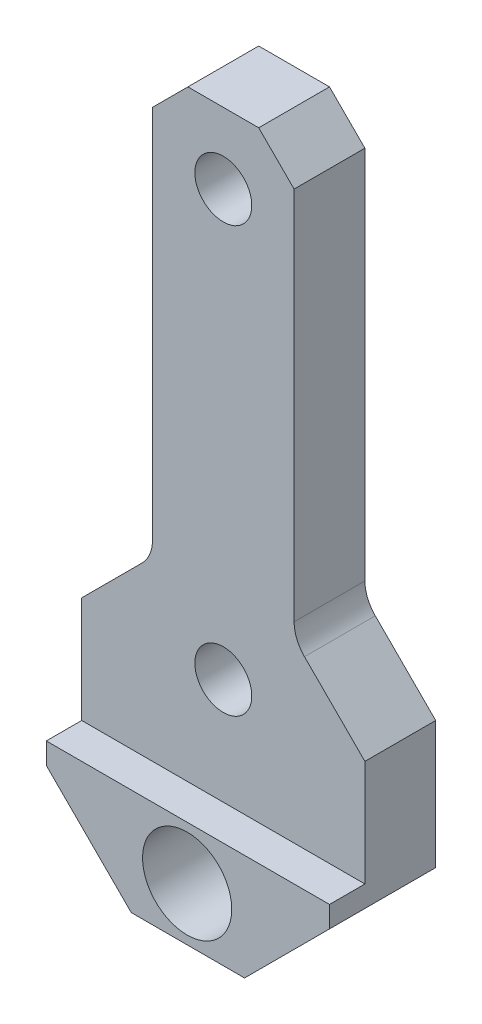
ISO-10303-21;
HEADER;
FILE_DESCRIPTION(('STEP AP214'),'2;1');
FILE_NAME('part.step','',(''),(''),'','','');
FILE_SCHEMA(('AUTOMOTIVE_DESIGN { 1 0 10303 214 1 1 1 1 }'));
ENDSEC;
DATA;
#1=APPLICATION_CONTEXT('core data for automotive mechanical design processes');
#2=APPLICATION_PROTOCOL_DEFINITION('international standard','automotive_design',2000,#1);
#3=PRODUCT_CONTEXT('',#1,'mechanical');
#4=PRODUCT('Part','Part','',(#3));
#5=PRODUCT_RELATED_PRODUCT_CATEGORY('part','',(#4));
#6=PRODUCT_DEFINITION_FORMATION('','',#4);
#7=PRODUCT_DEFINITION_CONTEXT('part definition',#1,'design');
#8=PRODUCT_DEFINITION('design','',#6,#7);
#9=PRODUCT_DEFINITION_SHAPE('','',#8);
#10=(LENGTH_UNIT() NAMED_UNIT(*) SI_UNIT(.MILLI.,.METRE.));
#11=(NAMED_UNIT(*) PLANE_ANGLE_UNIT() SI_UNIT($,.RADIAN.));
#12=(NAMED_UNIT(*) SI_UNIT($,.STERADIAN.) SOLID_ANGLE_UNIT());
#13=UNCERTAINTY_MEASURE_WITH_UNIT(LENGTH_MEASURE(1.E-05),#10,'distance_accuracy_value','');
#14=(GEOMETRIC_REPRESENTATION_CONTEXT(3) GLOBAL_UNCERTAINTY_ASSIGNED_CONTEXT((#13)) GLOBAL_UNIT_ASSIGNED_CONTEXT((#10,
#11,#12)) REPRESENTATION_CONTEXT('',''));
#15=CARTESIAN_POINT('',(0.,0.,0.));
#16=DIRECTION('',(0.,0.,1.));
#17=DIRECTION('',(1.,0.,0.));
#18=AXIS2_PLACEMENT_3D('',#15,#16,#17);
#19=CARTESIAN_POINT('',(0.,0.,0.));
#20=DIRECTION('',(0.,0.,1.));
#21=DIRECTION('',(1.,0.,0.));
#22=AXIS2_PLACEMENT_3D('',#19,#20,#21);
#23=PLANE('',#22);
#24=CARTESIAN_POINT('',(50.7326430152227,-4.7625,0.));
#25=DIRECTION('',(0.,0.,-1.));
#26=DIRECTION('',(-1.,0.,0.));
#27=AXIS2_PLACEMENT_3D('',#24,#25,#26);
#28=CIRCLE('',#27,4.);
#29=CARTESIAN_POINT('',(46.7326430152227,-4.7625,0.));
#30=VERTEX_POINT('',#29);
#31=EDGE_CURVE('E301',#30,#30,#28,.T.);
#32=ORIENTED_EDGE('',*,*,#31,.F.);
#33=EDGE_LOOP('',(#32));
#34=FACE_BOUND('',#33,.T.);
#35=CARTESIAN_POINT('',(50.8,9.525,0.));
#36=DIRECTION('',(0.,0.,-1.));
#37=DIRECTION('',(-1.,0.,0.));
#38=AXIS2_PLACEMENT_3D('',#35,#36,#37);
#39=CIRCLE('',#38,2.5527);
#40=CARTESIAN_POINT('',(48.2473,9.525,0.));
#41=VERTEX_POINT('',#40);
#42=EDGE_CURVE('E192',#41,#41,#39,.T.);
#43=ORIENTED_EDGE('',*,*,#42,.F.);
#44=EDGE_LOOP('',(#43));
#45=FACE_BOUND('',#44,.T.);
#46=DIRECTION('',(0.,-1.,0.));
#47=VECTOR('',#46,1.);
#48=CARTESIAN_POINT('',(44.45,53.975,0.));
#49=LINE('',#48,#47);
#50=CARTESIAN_POINT('',(44.45,50.8,0.));
#51=VERTEX_POINT('',#50);
#52=CARTESIAN_POINT('',(44.45,17.1901280605346,0.));
#53=VERTEX_POINT('',#52);
#54=EDGE_CURVE('E296',#51,#53,#49,.T.);
#55=ORIENTED_EDGE('',*,*,#54,.F.);
#56=DIRECTION('',(-0.707106781186548,-0.707106781186548,0.));
#57=VECTOR('',#56,1.);
#58=CARTESIAN_POINT('',(44.45,50.8,0.));
#59=LINE('',#58,#57);
#60=CARTESIAN_POINT('',(47.625,53.975,0.));
#61=VERTEX_POINT('',#60);
#62=EDGE_CURVE('E275',#51,#61,#59,.F.);
#63=ORIENTED_EDGE('',*,*,#62,.T.);
#64=DIRECTION('',(-1.,0.,0.));
#65=VECTOR('',#64,1.);
#66=CARTESIAN_POINT('',(57.15,53.975,0.));
#67=LINE('',#66,#65);
#68=CARTESIAN_POINT('',(53.975,53.975,0.));
#69=VERTEX_POINT('',#68);
#70=EDGE_CURVE('E295',#69,#61,#67,.T.);
#71=ORIENTED_EDGE('',*,*,#70,.F.);
#72=DIRECTION('',(-0.707106781186548,0.707106781186548,0.));
#73=VECTOR('',#72,1.);
#74=CARTESIAN_POINT('',(53.975,53.975,0.));
#75=LINE('',#74,#73);
#76=CARTESIAN_POINT('',(57.15,50.8,0.));
#77=VERTEX_POINT('',#76);
#78=EDGE_CURVE('E273',#69,#77,#75,.F.);
#79=ORIENTED_EDGE('',*,*,#78,.T.);
#80=DIRECTION('',(0.,1.,0.));
#81=VECTOR('',#80,1.);
#82=CARTESIAN_POINT('',(57.15,53.975,0.));
#83=LINE('',#82,#81);
#84=CARTESIAN_POINT('',(57.15,17.1901280605346,0.));
#85=VERTEX_POINT('',#84);
#86=EDGE_CURVE('E299',#85,#77,#83,.T.);
#87=ORIENTED_EDGE('',*,*,#86,.F.);
#88=CARTESIAN_POINT('',(60.325,17.1901280605346,0.));
#89=DIRECTION('',(0.,0.,1.));
#90=DIRECTION('',(1.,0.,0.));
#91=AXIS2_PLACEMENT_3D('',#88,#89,#90);
#92=CIRCLE('',#91,3.175);
#93=CARTESIAN_POINT('',(58.0799359697327,14.9450640302673,0.));
#94=VERTEX_POINT('',#93);
#95=EDGE_CURVE('E266',#85,#94,#92,.T.);
#96=ORIENTED_EDGE('',*,*,#95,.T.);
#97=DIRECTION('',(-0.707106781186549,0.707106781186546,0.));
#98=VECTOR('',#97,1.);
#99=CARTESIAN_POINT('',(63.5,9.52500000000001,0.));
#100=LINE('',#99,#98);
#101=CARTESIAN_POINT('',(63.5,9.52500000000001,0.));
#102=VERTEX_POINT('',#101);
#103=EDGE_CURVE('E238',#94,#102,#100,.F.);
#104=ORIENTED_EDGE('',*,*,#103,.T.);
#105=DIRECTION('',(0.,1.,0.));
#106=VECTOR('',#105,1.);
#107=CARTESIAN_POINT('',(63.5,57.15,0.));
#108=LINE('',#107,#106);
#109=CARTESIAN_POINT('',(63.5,-1.90499999999998,0.));
#110=VERTEX_POINT('',#109);
#111=EDGE_CURVE('E198',#110,#102,#108,.T.);
#112=ORIENTED_EDGE('',*,*,#111,.F.);
#113=DIRECTION('',(0.707106781186548,0.707106781186547,0.));
#114=VECTOR('',#113,1.);
#115=CARTESIAN_POINT('',(63.5,-1.90499999999998,0.));
#116=LINE('',#115,#114);
#117=CARTESIAN_POINT('',(55.88,-9.525,0.));
#118=VERTEX_POINT('',#117);
#119=EDGE_CURVE('E216',#110,#118,#116,.F.);
#120=ORIENTED_EDGE('',*,*,#119,.T.);
#121=DIRECTION('',(1.,0.,0.));
#122=VECTOR('',#121,1.);
#123=CARTESIAN_POINT('',(38.1,-9.525,0.));
#124=LINE('',#123,#122);
#125=CARTESIAN_POINT('',(45.72,-9.525,0.));
#126=VERTEX_POINT('',#125);
#127=EDGE_CURVE('E205',#126,#118,#124,.T.);
#128=ORIENTED_EDGE('',*,*,#127,.F.);
#129=DIRECTION('',(0.707106781186548,-0.707106781186547,0.));
#130=VECTOR('',#129,1.);
#131=CARTESIAN_POINT('',(45.72,-9.525,0.));
#132=LINE('',#131,#130);
#133=CARTESIAN_POINT('',(38.1,-1.90499999999999,0.));
#134=VERTEX_POINT('',#133);
#135=EDGE_CURVE('E218',#126,#134,#132,.F.);
#136=ORIENTED_EDGE('',*,*,#135,.T.);
#137=DIRECTION('',(0.,-1.,0.));
#138=VECTOR('',#137,1.);
#139=CARTESIAN_POINT('',(38.1,57.15,0.));
#140=LINE('',#139,#138);
#141=CARTESIAN_POINT('',(38.1,9.52500000000001,0.));
#142=VERTEX_POINT('',#141);
#143=EDGE_CURVE('E195',#142,#134,#140,.T.);
#144=ORIENTED_EDGE('',*,*,#143,.F.);
#145=DIRECTION('',(-0.707106781186548,-0.707106781186547,0.));
#146=VECTOR('',#145,1.);
#147=CARTESIAN_POINT('',(38.1,9.52500000000001,0.));
#148=LINE('',#147,#146);
#149=CARTESIAN_POINT('',(43.5200640302673,14.9450640302673,0.));
#150=VERTEX_POINT('',#149);
#151=EDGE_CURVE('E240',#142,#150,#148,.F.);
#152=ORIENTED_EDGE('',*,*,#151,.T.);
#153=CARTESIAN_POINT('',(41.275,17.1901280605346,0.));
#154=DIRECTION('',(0.,0.,1.));
#155=DIRECTION('',(1.,0.,0.));
#156=AXIS2_PLACEMENT_3D('',#153,#154,#155);
#157=CIRCLE('',#156,3.175);
#158=EDGE_CURVE('E261',#150,#53,#157,.T.);
#159=ORIENTED_EDGE('',*,*,#158,.T.);
#160=EDGE_LOOP('',(#55,#63,#71,#79,#87,#96,#104,#112,#120,#128,#136,#144,#152,#159));
#161=FACE_BOUND('',#160,.T.);
#162=CARTESIAN_POINT('',(50.8,47.625,0.));
#163=DIRECTION('',(0.,0.,-1.));
#164=DIRECTION('',(-1.,0.,0.));
#165=AXIS2_PLACEMENT_3D('',#162,#163,#164);
#166=CIRCLE('',#165,2.5527);
#167=CARTESIAN_POINT('',(48.2473,47.625,0.));
#168=VERTEX_POINT('',#167);
#169=EDGE_CURVE('E189',#168,#168,#166,.T.);
#170=ORIENTED_EDGE('',*,*,#169,.F.);
#171=EDGE_LOOP('',(#170));
#172=FACE_BOUND('',#171,.T.);
#173=ADVANCED_FACE('F34',(#34,#45,#161,#172),#23,.F.);
#174=CARTESIAN_POINT('',(38.1,57.15,9.525));
#175=DIRECTION('',(1.,0.,0.));
#176=DIRECTION('',(0.,1.,0.));
#177=AXIS2_PLACEMENT_3D('',#174,#175,#176);
#178=PLANE('',#177);
#179=DIRECTION('',(0.,1.,0.));
#180=VECTOR('',#179,1.);
#181=CARTESIAN_POINT('',(38.1,57.15,6.35));
#182=LINE('',#181,#180);
#183=CARTESIAN_POINT('',(38.1,0.,6.34999999999999));
#184=VERTEX_POINT('',#183);
#185=CARTESIAN_POINT('',(38.1,9.52500000000001,6.34999999999999));
#186=VERTEX_POINT('',#185);
#187=EDGE_CURVE('E164',#184,#186,#182,.T.);
#188=ORIENTED_EDGE('',*,*,#187,.T.);
#189=DIRECTION('',(0.,0.,-1.));
#190=VECTOR('',#189,1.);
#191=CARTESIAN_POINT('',(38.1,9.52500000000001,9.525));
#192=LINE('',#191,#190);
#193=EDGE_CURVE('E236',#186,#142,#192,.T.);
#194=ORIENTED_EDGE('',*,*,#193,.T.);
#195=ORIENTED_EDGE('',*,*,#143,.T.);
#196=DIRECTION('',(0.,0.,1.));
#197=VECTOR('',#196,1.);
#198=CARTESIAN_POINT('',(38.1,-1.90499999999999,9.525));
#199=LINE('',#198,#197);
#200=CARTESIAN_POINT('',(38.1,-1.90499999999999,9.525));
#201=VERTEX_POINT('',#200);
#202=EDGE_CURVE('E221',#134,#201,#199,.T.);
#203=ORIENTED_EDGE('',*,*,#202,.T.);
#204=DIRECTION('',(0.,-1.,0.));
#205=VECTOR('',#204,1.);
#206=CARTESIAN_POINT('',(38.1,57.15,9.525));
#207=LINE('',#206,#205);
#208=CARTESIAN_POINT('',(38.1,0.,9.525));
#209=VERTEX_POINT('',#208);
#210=EDGE_CURVE('E176',#209,#201,#207,.T.);
#211=ORIENTED_EDGE('',*,*,#210,.F.);
#212=DIRECTION('',(0.,0.,-1.));
#213=VECTOR('',#212,1.);
#214=CARTESIAN_POINT('',(38.1,0.,9.52499999999999));
#215=LINE('',#214,#213);
#216=EDGE_CURVE('E153',#209,#184,#215,.T.);
#217=ORIENTED_EDGE('',*,*,#216,.T.);
#218=EDGE_LOOP('',(#188,#194,#195,#203,#211,#217));
#219=FACE_BOUND('',#218,.T.);
#220=ADVANCED_FACE('F174',(#219),#178,.F.);
#221=CARTESIAN_POINT('',(38.1,-9.525,9.525));
#222=DIRECTION('',(0.,1.,0.));
#223=DIRECTION('',(0.,0.,1.));
#224=AXIS2_PLACEMENT_3D('',#221,#222,#223);
#225=PLANE('',#224);
#226=DIRECTION('',(1.,0.,0.));
#227=VECTOR('',#226,1.);
#228=CARTESIAN_POINT('',(38.1,-9.525,9.525));
#229=LINE('',#228,#227);
#230=CARTESIAN_POINT('',(45.72,-9.525,9.525));
#231=VERTEX_POINT('',#230);
#232=CARTESIAN_POINT('',(55.88,-9.525,9.525));
#233=VERTEX_POINT('',#232);
#234=EDGE_CURVE('E197',#231,#233,#229,.T.);
#235=ORIENTED_EDGE('',*,*,#234,.F.);
#236=DIRECTION('',(0.,0.,-1.));
#237=VECTOR('',#236,1.);
#238=CARTESIAN_POINT('',(45.72,-9.525,9.525));
#239=LINE('',#238,#237);
#240=EDGE_CURVE('E213',#231,#126,#239,.T.);
#241=ORIENTED_EDGE('',*,*,#240,.T.);
#242=ORIENTED_EDGE('',*,*,#127,.T.);
#243=DIRECTION('',(0.,0.,1.));
#244=VECTOR('',#243,1.);
#245=CARTESIAN_POINT('',(55.88,-9.525,9.525));
#246=LINE('',#245,#244);
#247=EDGE_CURVE('E203',#118,#233,#246,.T.);
#248=ORIENTED_EDGE('',*,*,#247,.T.);
#249=EDGE_LOOP('',(#235,#241,#242,#248));
#250=FACE_BOUND('',#249,.T.);
#251=ADVANCED_FACE('F326',(#250),#225,.F.);
#252=CARTESIAN_POINT('',(63.5,57.15,9.525));
#253=DIRECTION('',(-1.,0.,0.));
#254=DIRECTION('',(0.,-1.,0.));
#255=AXIS2_PLACEMENT_3D('',#252,#253,#254);
#256=PLANE('',#255);
#257=ORIENTED_EDGE('',*,*,#111,.T.);
#258=DIRECTION('',(0.,0.,1.));
#259=VECTOR('',#258,1.);
#260=CARTESIAN_POINT('',(63.5,9.52500000000001,9.525));
#261=LINE('',#260,#259);
#262=CARTESIAN_POINT('',(63.5,9.52500000000001,6.34999999999999));
#263=VERTEX_POINT('',#262);
#264=EDGE_CURVE('E247',#102,#263,#261,.T.);
#265=ORIENTED_EDGE('',*,*,#264,.T.);
#266=DIRECTION('',(0.,1.,0.));
#267=VECTOR('',#266,1.);
#268=CARTESIAN_POINT('',(63.5,57.15,6.35));
#269=LINE('',#268,#267);
#270=CARTESIAN_POINT('',(63.5,0.,6.34999999999999));
#271=VERTEX_POINT('',#270);
#272=EDGE_CURVE('E177',#271,#263,#269,.T.);
#273=ORIENTED_EDGE('',*,*,#272,.F.);
#274=DIRECTION('',(0.,0.,-1.));
#275=VECTOR('',#274,1.);
#276=CARTESIAN_POINT('',(63.5,0.,9.52499999999999));
#277=LINE('',#276,#275);
#278=CARTESIAN_POINT('',(63.5,0.,9.52499999999999));
#279=VERTEX_POINT('',#278);
#280=EDGE_CURVE('E156',#279,#271,#277,.T.);
#281=ORIENTED_EDGE('',*,*,#280,.F.);
#282=DIRECTION('',(0.,1.,0.));
#283=VECTOR('',#282,1.);
#284=CARTESIAN_POINT('',(63.5,57.15,9.525));
#285=LINE('',#284,#283);
#286=CARTESIAN_POINT('',(63.5,-1.90499999999998,9.525));
#287=VERTEX_POINT('',#286);
#288=EDGE_CURVE('E201',#287,#279,#285,.T.);
#289=ORIENTED_EDGE('',*,*,#288,.F.);
#290=DIRECTION('',(0.,0.,-1.));
#291=VECTOR('',#290,1.);
#292=CARTESIAN_POINT('',(63.5,-1.90499999999998,9.525));
#293=LINE('',#292,#291);
#294=EDGE_CURVE('E227',#287,#110,#293,.T.);
#295=ORIENTED_EDGE('',*,*,#294,.T.);
#296=EDGE_LOOP('',(#257,#265,#273,#281,#289,#295));
#297=FACE_BOUND('',#296,.T.);
#298=ADVANCED_FACE('F316',(#297),#256,.F.);
#299=CARTESIAN_POINT('',(0.,0.,9.525));
#300=DIRECTION('',(0.,0.,1.));
#301=DIRECTION('',(1.,0.,0.));
#302=AXIS2_PLACEMENT_3D('',#299,#300,#301);
#303=PLANE('',#302);
#304=CARTESIAN_POINT('',(50.7326430152227,-4.7625,9.525));
#305=DIRECTION('',(0.,0.,1.));
#306=DIRECTION('',(1.,0.,0.));
#307=AXIS2_PLACEMENT_3D('',#304,#305,#306);
#308=CIRCLE('',#307,4.);
#309=CARTESIAN_POINT('',(54.7326430152227,-4.7625,9.525));
#310=VERTEX_POINT('',#309);
#311=EDGE_CURVE('E181',#310,#310,#308,.T.);
#312=ORIENTED_EDGE('',*,*,#311,.F.);
#313=EDGE_LOOP('',(#312));
#314=FACE_BOUND('',#313,.T.);
#315=ORIENTED_EDGE('',*,*,#210,.T.);
#316=DIRECTION('',(-0.707106781186548,0.707106781186547,0.));
#317=VECTOR('',#316,1.);
#318=CARTESIAN_POINT('',(18.0975,18.0975,9.525));
#319=LINE('',#318,#317);
#320=EDGE_CURVE('E225',#201,#231,#319,.F.);
#321=ORIENTED_EDGE('',*,*,#320,.T.);
#322=ORIENTED_EDGE('',*,*,#234,.T.);
#323=DIRECTION('',(-0.707106781186548,-0.707106781186547,0.));
#324=VECTOR('',#323,1.);
#325=CARTESIAN_POINT('',(32.7024999999999,-32.7025,9.525));
#326=LINE('',#325,#324);
#327=EDGE_CURVE('E223',#233,#287,#326,.F.);
#328=ORIENTED_EDGE('',*,*,#327,.T.);
#329=ORIENTED_EDGE('',*,*,#288,.T.);
#330=DIRECTION('',(1.,0.,0.));
#331=VECTOR('',#330,1.);
#332=CARTESIAN_POINT('',(38.1,0.,9.52499999999999));
#333=LINE('',#332,#331);
#334=EDGE_CURVE('E161',#209,#279,#333,.T.);
#335=ORIENTED_EDGE('',*,*,#334,.F.);
#336=EDGE_LOOP('',(#315,#321,#322,#328,#329,#335));
#337=FACE_BOUND('',#336,.T.);
#338=ADVANCED_FACE('F312',(#314,#337),#303,.T.);
#339=CARTESIAN_POINT('',(50.8,9.525,0.));
#340=DIRECTION('',(0.,0.,-1.));
#341=DIRECTION('',(-1.,0.,0.));
#342=AXIS2_PLACEMENT_3D('',#339,#340,#341);
#343=CYLINDRICAL_SURFACE('',#342,2.5527);
#344=CARTESIAN_POINT('',(50.8,9.525,6.34999999999999));
#345=DIRECTION('',(0.,0.,-1.));
#346=DIRECTION('',(0.,1.,0.));
#347=AXIS2_PLACEMENT_3D('',#344,#345,#346);
#348=CIRCLE('',#347,2.5527);
#349=CARTESIAN_POINT('',(50.8,12.0777,6.34999999999999));
#350=VERTEX_POINT('',#349);
#351=EDGE_CURVE('E186',#350,#350,#348,.F.);
#352=ORIENTED_EDGE('',*,*,#351,.T.);
#353=EDGE_LOOP('',(#352));
#354=FACE_BOUND('',#353,.T.);
#355=ORIENTED_EDGE('',*,*,#42,.T.);
#356=EDGE_LOOP('',(#355));
#357=FACE_BOUND('',#356,.T.);
#358=ADVANCED_FACE('F315',(#354,#357),#343,.F.);
#359=CARTESIAN_POINT('',(50.8,47.625,0.));
#360=DIRECTION('',(0.,0.,-1.));
#361=DIRECTION('',(-1.,0.,0.));
#362=AXIS2_PLACEMENT_3D('',#359,#360,#361);
#363=CYLINDRICAL_SURFACE('',#362,2.5527);
#364=CARTESIAN_POINT('',(50.8,47.625,6.35));
#365=DIRECTION('',(0.,0.,-1.));
#366=DIRECTION('',(0.,1.,0.));
#367=AXIS2_PLACEMENT_3D('',#364,#365,#366);
#368=CIRCLE('',#367,2.5527);
#369=CARTESIAN_POINT('',(50.8,50.1777,6.35));
#370=VERTEX_POINT('',#369);
#371=EDGE_CURVE('E160',#370,#370,#368,.F.);
#372=ORIENTED_EDGE('',*,*,#371,.T.);
#373=EDGE_LOOP('',(#372));
#374=FACE_BOUND('',#373,.T.);
#375=ORIENTED_EDGE('',*,*,#169,.T.);
#376=EDGE_LOOP('',(#375));
#377=FACE_BOUND('',#376,.T.);
#378=ADVANCED_FACE('F428',(#374,#377),#363,.F.);
#379=CARTESIAN_POINT('',(38.1,57.15,6.35));
#380=DIRECTION('',(0.,0.,-1.));
#381=DIRECTION('',(0.,1.,0.));
#382=AXIS2_PLACEMENT_3D('',#379,#380,#381);
#383=PLANE('',#382);
#384=DIRECTION('',(-1.,0.,0.));
#385=VECTOR('',#384,1.);
#386=CARTESIAN_POINT('',(38.1,53.975,6.35));
#387=LINE('',#386,#385);
#388=CARTESIAN_POINT('',(53.975,53.975,6.35));
#389=VERTEX_POINT('',#388);
#390=CARTESIAN_POINT('',(47.625,53.975,6.35));
#391=VERTEX_POINT('',#390);
#392=EDGE_CURVE('E230',#389,#391,#387,.T.);
#393=ORIENTED_EDGE('',*,*,#392,.T.);
#394=DIRECTION('',(0.707106781186548,0.707106781186548,0.));
#395=VECTOR('',#394,1.);
#396=CARTESIAN_POINT('',(44.45,50.8,6.35));
#397=LINE('',#396,#395);
#398=CARTESIAN_POINT('',(44.45,50.8,6.35));
#399=VERTEX_POINT('',#398);
#400=EDGE_CURVE('E42',#391,#399,#397,.F.);
#401=ORIENTED_EDGE('',*,*,#400,.T.);
#402=DIRECTION('',(0.,-1.,0.));
#403=VECTOR('',#402,1.);
#404=CARTESIAN_POINT('',(44.45,57.15,6.35));
#405=LINE('',#404,#403);
#406=CARTESIAN_POINT('',(44.45,17.1901280605346,6.35));
#407=VERTEX_POINT('',#406);
#408=EDGE_CURVE('E232',#399,#407,#405,.T.);
#409=ORIENTED_EDGE('',*,*,#408,.T.);
#410=CARTESIAN_POINT('',(41.275,17.1901280605346,6.35));
#411=DIRECTION('',(0.,0.,-1.));
#412=DIRECTION('',(0.,1.,0.));
#413=AXIS2_PLACEMENT_3D('',#410,#411,#412);
#414=CIRCLE('',#413,3.175);
#415=CARTESIAN_POINT('',(43.5200640302673,14.9450640302673,6.35));
#416=VERTEX_POINT('',#415);
#417=EDGE_CURVE('E264',#407,#416,#414,.T.);
#418=ORIENTED_EDGE('',*,*,#417,.T.);
#419=DIRECTION('',(0.707106781186548,0.707106781186547,0.));
#420=VECTOR('',#419,1.);
#421=CARTESIAN_POINT('',(38.1,9.52500000000001,6.34999999999999));
#422=LINE('',#421,#420);
#423=EDGE_CURVE('E168',#416,#186,#422,.F.);
#424=ORIENTED_EDGE('',*,*,#423,.T.);
#425=ORIENTED_EDGE('',*,*,#187,.F.);
#426=DIRECTION('',(1.,0.,0.));
#427=VECTOR('',#426,1.);
#428=CARTESIAN_POINT('',(38.1,0.,6.34999999999999));
#429=LINE('',#428,#427);
#430=EDGE_CURVE('E148',#184,#271,#429,.T.);
#431=ORIENTED_EDGE('',*,*,#430,.T.);
#432=ORIENTED_EDGE('',*,*,#272,.T.);
#433=DIRECTION('',(0.707106781186549,-0.707106781186546,0.));
#434=VECTOR('',#433,1.);
#435=CARTESIAN_POINT('',(63.5,9.52500000000001,6.34999999999999));
#436=LINE('',#435,#434);
#437=CARTESIAN_POINT('',(58.0799359697327,14.9450640302673,6.35));
#438=VERTEX_POINT('',#437);
#439=EDGE_CURVE('E243',#263,#438,#436,.F.);
#440=ORIENTED_EDGE('',*,*,#439,.T.);
#441=CARTESIAN_POINT('',(60.325,17.1901280605346,6.35));
#442=DIRECTION('',(0.,0.,-1.));
#443=DIRECTION('',(0.,1.,0.));
#444=AXIS2_PLACEMENT_3D('',#441,#442,#443);
#445=CIRCLE('',#444,3.175);
#446=CARTESIAN_POINT('',(57.15,17.1901280605346,6.35));
#447=VERTEX_POINT('',#446);
#448=EDGE_CURVE('E268',#438,#447,#445,.T.);
#449=ORIENTED_EDGE('',*,*,#448,.T.);
#450=DIRECTION('',(0.,1.,0.));
#451=VECTOR('',#450,1.);
#452=CARTESIAN_POINT('',(57.15,57.15,6.35));
#453=LINE('',#452,#451);
#454=CARTESIAN_POINT('',(57.15,50.8,6.35));
#455=VERTEX_POINT('',#454);
#456=EDGE_CURVE('E234',#447,#455,#453,.T.);
#457=ORIENTED_EDGE('',*,*,#456,.T.);
#458=DIRECTION('',(0.707106781186548,-0.707106781186548,0.));
#459=VECTOR('',#458,1.);
#460=CARTESIAN_POINT('',(53.975,53.975,6.35));
#461=LINE('',#460,#459);
#462=EDGE_CURVE('E281',#455,#389,#461,.F.);
#463=ORIENTED_EDGE('',*,*,#462,.T.);
#464=EDGE_LOOP('',(#393,#401,#409,#418,#424,#425,#431,#432,#440,#449,#457,#463));
#465=FACE_BOUND('',#464,.T.);
#466=ORIENTED_EDGE('',*,*,#371,.F.);
#467=EDGE_LOOP('',(#466));
#468=FACE_BOUND('',#467,.T.);
#469=ORIENTED_EDGE('',*,*,#351,.F.);
#470=EDGE_LOOP('',(#469));
#471=FACE_BOUND('',#470,.T.);
#472=ADVANCED_FACE('F165',(#465,#468,#471),#383,.F.);
#473=CARTESIAN_POINT('',(38.1,0.,9.52499999999999));
#474=DIRECTION('',(0.,-1.,0.));
#475=DIRECTION('',(1.,0.,0.));
#476=AXIS2_PLACEMENT_3D('',#473,#474,#475);
#477=PLANE('',#476);
#478=ORIENTED_EDGE('',*,*,#280,.T.);
#479=ORIENTED_EDGE('',*,*,#430,.F.);
#480=ORIENTED_EDGE('',*,*,#216,.F.);
#481=ORIENTED_EDGE('',*,*,#334,.T.);
#482=EDGE_LOOP('',(#478,#479,#480,#481));
#483=FACE_BOUND('',#482,.T.);
#484=ADVANCED_FACE('F150',(#483),#477,.F.);
#485=CARTESIAN_POINT('',(50.7326430152227,-4.7625,0.));
#486=DIRECTION('',(0.,0.,-1.));
#487=DIRECTION('',(-1.,0.,0.));
#488=AXIS2_PLACEMENT_3D('',#485,#486,#487);
#489=CYLINDRICAL_SURFACE('',#488,4.);
#490=ORIENTED_EDGE('',*,*,#31,.T.);
#491=EDGE_LOOP('',(#490));
#492=FACE_BOUND('',#491,.T.);
#493=ORIENTED_EDGE('',*,*,#311,.T.);
#494=EDGE_LOOP('',(#493));
#495=FACE_BOUND('',#494,.T.);
#496=ADVANCED_FACE('F310',(#492,#495),#489,.F.);
#497=CARTESIAN_POINT('',(45.72,-9.525,9.525));
#498=DIRECTION('',(0.707106781186547,0.707106781186548,0.));
#499=DIRECTION('',(0.,0.,-1.));
#500=AXIS2_PLACEMENT_3D('',#497,#498,#499);
#501=PLANE('',#500);
#502=ORIENTED_EDGE('',*,*,#320,.F.);
#503=ORIENTED_EDGE('',*,*,#202,.F.);
#504=ORIENTED_EDGE('',*,*,#135,.F.);
#505=ORIENTED_EDGE('',*,*,#240,.F.);
#506=EDGE_LOOP('',(#502,#503,#504,#505));
#507=FACE_BOUND('',#506,.T.);
#508=ADVANCED_FACE('F323',(#507),#501,.F.);
#509=CARTESIAN_POINT('',(63.5,-1.90499999999998,9.525));
#510=DIRECTION('',(-0.707106781186547,0.707106781186548,0.));
#511=DIRECTION('',(0.,0.,-1.));
#512=AXIS2_PLACEMENT_3D('',#509,#510,#511);
#513=PLANE('',#512);
#514=ORIENTED_EDGE('',*,*,#327,.F.);
#515=ORIENTED_EDGE('',*,*,#247,.F.);
#516=ORIENTED_EDGE('',*,*,#119,.F.);
#517=ORIENTED_EDGE('',*,*,#294,.F.);
#518=EDGE_LOOP('',(#514,#515,#516,#517));
#519=FACE_BOUND('',#518,.T.);
#520=ADVANCED_FACE('F333',(#519),#513,.F.);
#521=CARTESIAN_POINT('',(57.15,53.975,9.525));
#522=DIRECTION('',(-1.,0.,0.));
#523=DIRECTION('',(0.,-1.,0.));
#524=AXIS2_PLACEMENT_3D('',#521,#522,#523);
#525=PLANE('',#524);
#526=ORIENTED_EDGE('',*,*,#86,.T.);
#527=DIRECTION('',(0.,0.,1.));
#528=VECTOR('',#527,1.);
#529=CARTESIAN_POINT('',(57.15,50.8,9.525));
#530=LINE('',#529,#528);
#531=EDGE_CURVE('E11',#77,#455,#530,.T.);
#532=ORIENTED_EDGE('',*,*,#531,.T.);
#533=ORIENTED_EDGE('',*,*,#456,.F.);
#534=DIRECTION('',(0.,0.,1.));
#535=VECTOR('',#534,1.);
#536=CARTESIAN_POINT('',(57.15,17.1901280605346,9.525));
#537=LINE('',#536,#535);
#538=EDGE_CURVE('E256',#447,#85,#537,.F.);
#539=ORIENTED_EDGE('',*,*,#538,.T.);
#540=EDGE_LOOP('',(#526,#532,#533,#539));
#541=FACE_BOUND('',#540,.T.);
#542=ADVANCED_FACE('F344',(#541),#525,.F.);
#543=CARTESIAN_POINT('',(44.45,53.975,9.525));
#544=DIRECTION('',(1.,0.,0.));
#545=DIRECTION('',(0.,1.,0.));
#546=AXIS2_PLACEMENT_3D('',#543,#544,#545);
#547=PLANE('',#546);
#548=ORIENTED_EDGE('',*,*,#408,.F.);
#549=DIRECTION('',(0.,0.,-1.));
#550=VECTOR('',#549,1.);
#551=CARTESIAN_POINT('',(44.45,50.8,9.525));
#552=LINE('',#551,#550);
#553=EDGE_CURVE('E270',#399,#51,#552,.T.);
#554=ORIENTED_EDGE('',*,*,#553,.T.);
#555=ORIENTED_EDGE('',*,*,#54,.T.);
#556=DIRECTION('',(0.,0.,1.));
#557=VECTOR('',#556,1.);
#558=CARTESIAN_POINT('',(44.45,17.1901280605346,9.525));
#559=LINE('',#558,#557);
#560=EDGE_CURVE('E253',#53,#407,#559,.T.);
#561=ORIENTED_EDGE('',*,*,#560,.T.);
#562=EDGE_LOOP('',(#548,#554,#555,#561));
#563=FACE_BOUND('',#562,.T.);
#564=ADVANCED_FACE('F287',(#563),#547,.F.);
#565=CARTESIAN_POINT('',(57.15,53.975,9.525));
#566=DIRECTION('',(0.,-1.,0.));
#567=DIRECTION('',(0.,0.,-1.));
#568=AXIS2_PLACEMENT_3D('',#565,#566,#567);
#569=PLANE('',#568);
#570=ORIENTED_EDGE('',*,*,#70,.T.);
#571=DIRECTION('',(0.,0.,1.));
#572=VECTOR('',#571,1.);
#573=CARTESIAN_POINT('',(47.625,53.975,9.525));
#574=LINE('',#573,#572);
#575=EDGE_CURVE('E55',#61,#391,#574,.T.);
#576=ORIENTED_EDGE('',*,*,#575,.T.);
#577=ORIENTED_EDGE('',*,*,#392,.F.);
#578=DIRECTION('',(0.,0.,-1.));
#579=VECTOR('',#578,1.);
#580=CARTESIAN_POINT('',(53.975,53.975,9.525));
#581=LINE('',#580,#579);
#582=EDGE_CURVE('E277',#389,#69,#581,.T.);
#583=ORIENTED_EDGE('',*,*,#582,.T.);
#584=EDGE_LOOP('',(#570,#576,#577,#583));
#585=FACE_BOUND('',#584,.T.);
#586=ADVANCED_FACE('F297',(#585),#569,.F.);
#587=CARTESIAN_POINT('',(38.1,9.52500000000001,9.525));
#588=DIRECTION('',(0.707106781186547,-0.707106781186548,0.));
#589=DIRECTION('',(0.,0.,-1.));
#590=AXIS2_PLACEMENT_3D('',#587,#588,#589);
#591=PLANE('',#590);
#592=ORIENTED_EDGE('',*,*,#423,.F.);
#593=DIRECTION('',(0.,0.,-1.));
#594=VECTOR('',#593,1.);
#595=CARTESIAN_POINT('',(43.5200640302673,14.9450640302673,9.525));
#596=LINE('',#595,#594);
#597=EDGE_CURVE('E250',#416,#150,#596,.T.);
#598=ORIENTED_EDGE('',*,*,#597,.T.);
#599=ORIENTED_EDGE('',*,*,#151,.F.);
#600=ORIENTED_EDGE('',*,*,#193,.F.);
#601=EDGE_LOOP('',(#592,#598,#599,#600));
#602=FACE_BOUND('',#601,.T.);
#603=ADVANCED_FACE('F370',(#602),#591,.F.);
#604=CARTESIAN_POINT('',(63.5,9.52500000000001,9.525));
#605=DIRECTION('',(-0.707106781186546,-0.707106781186549,0.));
#606=DIRECTION('',(0.,0.,1.));
#607=AXIS2_PLACEMENT_3D('',#604,#605,#606);
#608=PLANE('',#607);
#609=ORIENTED_EDGE('',*,*,#103,.F.);
#610=DIRECTION('',(0.,0.,-1.));
#611=VECTOR('',#610,1.);
#612=CARTESIAN_POINT('',(58.0799359697327,14.9450640302673,9.525));
#613=LINE('',#612,#611);
#614=EDGE_CURVE('E259',#94,#438,#613,.F.);
#615=ORIENTED_EDGE('',*,*,#614,.T.);
#616=ORIENTED_EDGE('',*,*,#439,.F.);
#617=ORIENTED_EDGE('',*,*,#264,.F.);
#618=EDGE_LOOP('',(#609,#615,#616,#617));
#619=FACE_BOUND('',#618,.T.);
#620=ADVANCED_FACE('F373',(#619),#608,.F.);
#621=CARTESIAN_POINT('',(41.275,17.1901280605346,9.525));
#622=DIRECTION('',(0.,0.,1.));
#623=DIRECTION('',(1.,0.,0.));
#624=AXIS2_PLACEMENT_3D('',#621,#622,#623);
#625=CYLINDRICAL_SURFACE('',#624,3.175);
#626=ORIENTED_EDGE('',*,*,#417,.F.);
#627=ORIENTED_EDGE('',*,*,#560,.F.);
#628=ORIENTED_EDGE('',*,*,#158,.F.);
#629=ORIENTED_EDGE('',*,*,#597,.F.);
#630=EDGE_LOOP('',(#626,#627,#628,#629));
#631=FACE_BOUND('',#630,.T.);
#632=ADVANCED_FACE('F377',(#631),#625,.F.);
#633=CARTESIAN_POINT('',(60.325,17.1901280605346,9.525));
#634=DIRECTION('',(0.,0.,1.));
#635=DIRECTION('',(1.,0.,0.));
#636=AXIS2_PLACEMENT_3D('',#633,#634,#635);
#637=CYLINDRICAL_SURFACE('',#636,3.175);
#638=ORIENTED_EDGE('',*,*,#448,.F.);
#639=ORIENTED_EDGE('',*,*,#614,.F.);
#640=ORIENTED_EDGE('',*,*,#95,.F.);
#641=ORIENTED_EDGE('',*,*,#538,.F.);
#642=EDGE_LOOP('',(#638,#639,#640,#641));
#643=FACE_BOUND('',#642,.T.);
#644=ADVANCED_FACE('F342',(#643),#637,.F.);
#645=CARTESIAN_POINT('',(44.45,50.8,9.525));
#646=DIRECTION('',(0.707106781186548,-0.707106781186548,0.));
#647=DIRECTION('',(0.,0.,-1.));
#648=AXIS2_PLACEMENT_3D('',#645,#646,#647);
#649=PLANE('',#648);
#650=ORIENTED_EDGE('',*,*,#400,.F.);
#651=ORIENTED_EDGE('',*,*,#575,.F.);
#652=ORIENTED_EDGE('',*,*,#62,.F.);
#653=ORIENTED_EDGE('',*,*,#553,.F.);
#654=EDGE_LOOP('',(#650,#651,#652,#653));
#655=FACE_BOUND('',#654,.T.);
#656=ADVANCED_FACE('F291',(#655),#649,.F.);
#657=CARTESIAN_POINT('',(53.975,53.975,9.525));
#658=DIRECTION('',(-0.707106781186548,-0.707106781186548,0.));
#659=DIRECTION('',(0.,0.,-1.));
#660=AXIS2_PLACEMENT_3D('',#657,#658,#659);
#661=PLANE('',#660);
#662=ORIENTED_EDGE('',*,*,#462,.F.);
#663=ORIENTED_EDGE('',*,*,#531,.F.);
#664=ORIENTED_EDGE('',*,*,#78,.F.);
#665=ORIENTED_EDGE('',*,*,#582,.F.);
#666=EDGE_LOOP('',(#662,#663,#664,#665));
#667=FACE_BOUND('',#666,.T.);
#668=ADVANCED_FACE('F36',(#667),#661,.F.);
#669=CLOSED_SHELL('',(#173,#220,#251,#298,#338,#358,#378,#472,#484,#496,#508,#520,#542,#564,
#586,#603,#620,#632,#644,#656,#668));
#670=MANIFOLD_SOLID_BREP('B2',#669);
#671=ADVANCED_BREP_SHAPE_REPRESENTATION('',(#18,#670),#14);
#672=SHAPE_DEFINITION_REPRESENTATION(#9,#671);
ENDSEC;
END-ISO-10303-21;
